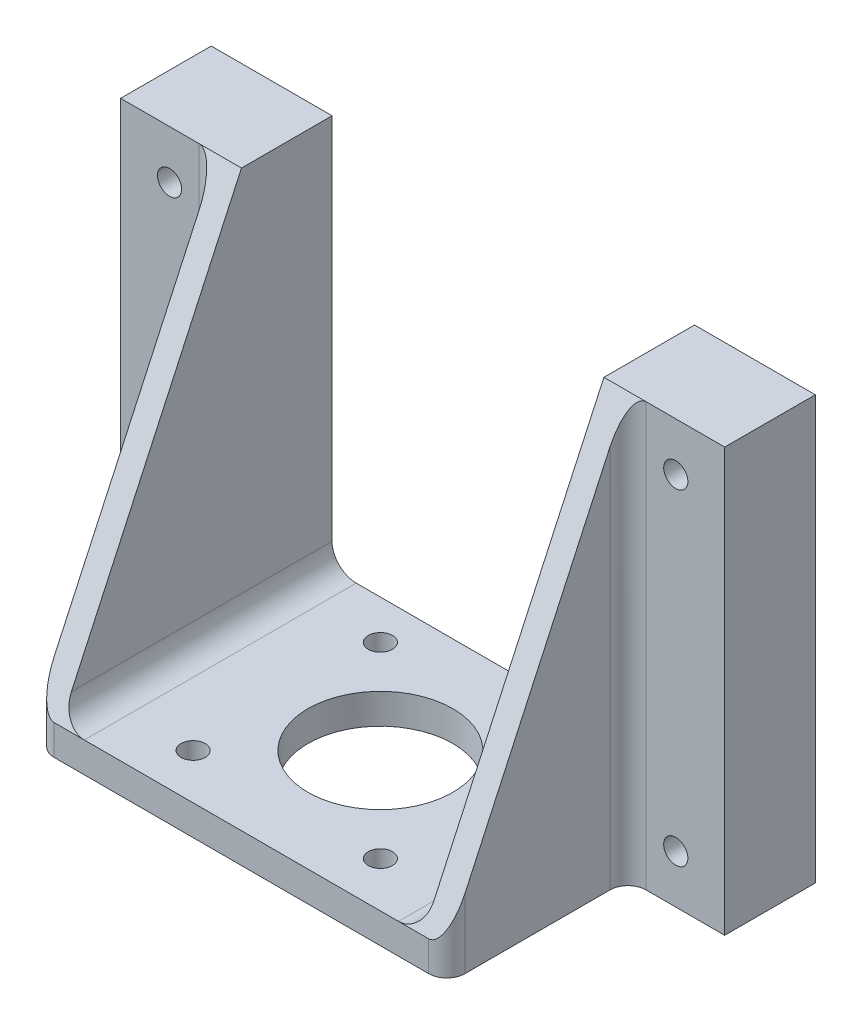
ISO-10303-21;
HEADER;
FILE_DESCRIPTION(('STEP AP214'),'2;1');
FILE_NAME('part.step','',(''),(''),'','','');
FILE_SCHEMA(('AUTOMOTIVE_DESIGN { 1 0 10303 214 1 1 1 1 }'));
ENDSEC;
DATA;
#1=APPLICATION_CONTEXT('core data for automotive mechanical design processes');
#2=APPLICATION_PROTOCOL_DEFINITION('international standard','automotive_design',2000,#1);
#3=PRODUCT_CONTEXT('',#1,'mechanical');
#4=PRODUCT('Part','Part','',(#3));
#5=PRODUCT_RELATED_PRODUCT_CATEGORY('part','',(#4));
#6=PRODUCT_DEFINITION_FORMATION('','',#4);
#7=PRODUCT_DEFINITION_CONTEXT('part definition',#1,'design');
#8=PRODUCT_DEFINITION('design','',#6,#7);
#9=PRODUCT_DEFINITION_SHAPE('','',#8);
#10=(LENGTH_UNIT() NAMED_UNIT(*) SI_UNIT(.MILLI.,.METRE.));
#11=(NAMED_UNIT(*) PLANE_ANGLE_UNIT() SI_UNIT($,.RADIAN.));
#12=(NAMED_UNIT(*) SI_UNIT($,.STERADIAN.) SOLID_ANGLE_UNIT());
#13=UNCERTAINTY_MEASURE_WITH_UNIT(LENGTH_MEASURE(1.E-05),#10,'distance_accuracy_value','');
#14=(GEOMETRIC_REPRESENTATION_CONTEXT(3) GLOBAL_UNCERTAINTY_ASSIGNED_CONTEXT((#13)) GLOBAL_UNIT_ASSIGNED_CONTEXT((#10,
#11,#12)) REPRESENTATION_CONTEXT('',''));
#15=CARTESIAN_POINT('',(0.,0.,0.));
#16=DIRECTION('',(0.,0.,1.));
#17=DIRECTION('',(1.,0.,0.));
#18=AXIS2_PLACEMENT_3D('',#15,#16,#17);
#19=CARTESIAN_POINT('',(0.,35.,0.0001));
#20=DIRECTION('',(0.,1.,0.));
#21=DIRECTION('',(0.,0.,1.));
#22=AXIS2_PLACEMENT_3D('',#19,#20,#21);
#23=PLANE('',#22);
#24=DIRECTION('',(0.,0.,-1.));
#25=VECTOR('',#24,1.);
#26=CARTESIAN_POINT('',(-30.,35.,45.0001));
#27=LINE('',#26,#25);
#28=CARTESIAN_POINT('',(-30.,35.,15.0001));
#29=VERTEX_POINT('',#28);
#30=CARTESIAN_POINT('',(-30.,35.,0.));
#31=VERTEX_POINT('',#30);
#32=EDGE_CURVE('E330',#29,#31,#27,.T.);
#33=ORIENTED_EDGE('',*,*,#32,.T.);
#34=DIRECTION('',(1.,0.,0.));
#35=VECTOR('',#34,1.);
#36=CARTESIAN_POINT('',(0.,35.,0.));
#37=LINE('',#36,#35);
#38=CARTESIAN_POINT('',(-50.,35.,0.));
#39=VERTEX_POINT('',#38);
#40=EDGE_CURVE('E225',#39,#31,#37,.T.);
#41=ORIENTED_EDGE('',*,*,#40,.F.);
#42=DIRECTION('',(0.,0.,-1.));
#43=VECTOR('',#42,1.);
#44=CARTESIAN_POINT('',(-50.,35.,0.0001));
#45=LINE('',#44,#43);
#46=CARTESIAN_POINT('',(-50.,35.,15.0001));
#47=VERTEX_POINT('',#46);
#48=EDGE_CURVE('E246',#47,#39,#45,.T.);
#49=ORIENTED_EDGE('',*,*,#48,.F.);
#50=DIRECTION('',(-1.,0.,0.));
#51=VECTOR('',#50,1.);
#52=CARTESIAN_POINT('',(-34.,35.,15.0001));
#53=LINE('',#52,#51);
#54=CARTESIAN_POINT('',(-37.,35.,15.0001));
#55=VERTEX_POINT('',#54);
#56=EDGE_CURVE('E367',#55,#47,#53,.T.);
#57=ORIENTED_EDGE('',*,*,#56,.F.);
#58=DIRECTION('',(-1.,0.,0.));
#59=VECTOR('',#58,1.);
#60=CARTESIAN_POINT('',(42.,35.,15.0001));
#61=LINE('',#60,#59);
#62=EDGE_CURVE('E382',#29,#55,#61,.T.);
#63=ORIENTED_EDGE('',*,*,#62,.F.);
#64=EDGE_LOOP('',(#33,#41,#49,#57,#63));
#65=FACE_BOUND('',#64,.T.);
#66=ADVANCED_FACE('F67',(#65),#23,.T.);
#67=CARTESIAN_POINT('',(0.,0.,15.0001));
#68=DIRECTION('',(0.,0.,1.));
#69=DIRECTION('',(1.,0.,0.));
#70=AXIS2_PLACEMENT_3D('',#67,#68,#69);
#71=PLANE('',#70);
#72=DIRECTION('',(-1.,0.,0.));
#73=VECTOR('',#72,1.);
#74=CARTESIAN_POINT('',(50.,35.,15.0001));
#75=LINE('',#74,#73);
#76=CARTESIAN_POINT('',(50.,35.,15.0001));
#77=VERTEX_POINT('',#76);
#78=CARTESIAN_POINT('',(37.,35.,15.0001));
#79=VERTEX_POINT('',#78);
#80=EDGE_CURVE('E375',#77,#79,#75,.T.);
#81=ORIENTED_EDGE('',*,*,#80,.T.);
#82=DIRECTION('',(0.,-1.,0.));
#83=VECTOR('',#82,1.);
#84=CARTESIAN_POINT('',(37.,0.,15.0001));
#85=LINE('',#84,#83);
#86=CARTESIAN_POINT('',(37.,-35.,15.0001));
#87=VERTEX_POINT('',#86);
#88=EDGE_CURVE('E290',#79,#87,#85,.T.);
#89=ORIENTED_EDGE('',*,*,#88,.T.);
#90=DIRECTION('',(1.,0.,0.));
#91=VECTOR('',#90,1.);
#92=CARTESIAN_POINT('',(34.,-35.,15.0001));
#93=LINE('',#92,#91);
#94=CARTESIAN_POINT('',(50.,-35.,15.0001));
#95=VERTEX_POINT('',#94);
#96=EDGE_CURVE('E378',#87,#95,#93,.T.);
#97=ORIENTED_EDGE('',*,*,#96,.T.);
#98=DIRECTION('',(0.,1.,0.));
#99=VECTOR('',#98,1.);
#100=CARTESIAN_POINT('',(50.,-35.,15.0001));
#101=LINE('',#100,#99);
#102=EDGE_CURVE('E372',#95,#77,#101,.T.);
#103=ORIENTED_EDGE('',*,*,#102,.T.);
#104=EDGE_LOOP('',(#81,#89,#97,#103));
#105=FACE_BOUND('',#104,.T.);
#106=CARTESIAN_POINT('',(41.8999999999999,27.,15.0001));
#107=DIRECTION('',(0.,0.,1.));
#108=DIRECTION('',(1.,0.,0.));
#109=AXIS2_PLACEMENT_3D('',#106,#107,#108);
#110=CIRCLE('',#109,2.00000000000002);
#111=CARTESIAN_POINT('',(43.9,27.,15.0001));
#112=VERTEX_POINT('',#111);
#113=EDGE_CURVE('E358',#112,#112,#110,.T.);
#114=ORIENTED_EDGE('',*,*,#113,.F.);
#115=EDGE_LOOP('',(#114));
#116=FACE_BOUND('',#115,.T.);
#117=CARTESIAN_POINT('',(41.8999999999999,-27.,15.0001));
#118=DIRECTION('',(0.,0.,1.));
#119=DIRECTION('',(1.,0.,0.));
#120=AXIS2_PLACEMENT_3D('',#117,#118,#119);
#121=CIRCLE('',#120,2.00000000000004);
#122=CARTESIAN_POINT('',(43.9,-27.,15.0001));
#123=VERTEX_POINT('',#122);
#124=EDGE_CURVE('E361',#123,#123,#121,.F.);
#125=ORIENTED_EDGE('',*,*,#124,.T.);
#126=EDGE_LOOP('',(#125));
#127=FACE_BOUND('',#126,.T.);
#128=ADVANCED_FACE('F425',(#105,#116,#127),#71,.T.);
#129=CARTESIAN_POINT('',(0.,0.,15.0001));
#130=DIRECTION('',(0.,0.,1.));
#131=DIRECTION('',(1.,0.,0.));
#132=AXIS2_PLACEMENT_3D('',#129,#130,#131);
#133=PLANE('',#132);
#134=CARTESIAN_POINT('',(-41.9,27.,15.0001));
#135=DIRECTION('',(0.,0.,1.));
#136=DIRECTION('',(1.,0.,0.));
#137=AXIS2_PLACEMENT_3D('',#134,#135,#136);
#138=CIRCLE('',#137,2.);
#139=CARTESIAN_POINT('',(-39.9,27.,15.0001));
#140=VERTEX_POINT('',#139);
#141=EDGE_CURVE('E355',#140,#140,#138,.F.);
#142=ORIENTED_EDGE('',*,*,#141,.T.);
#143=EDGE_LOOP('',(#142));
#144=FACE_BOUND('',#143,.T.);
#145=DIRECTION('',(1.,0.,0.));
#146=VECTOR('',#145,1.);
#147=CARTESIAN_POINT('',(-50.,-35.,15.0001));
#148=LINE('',#147,#146);
#149=CARTESIAN_POINT('',(-50.,-35.,15.0001));
#150=VERTEX_POINT('',#149);
#151=CARTESIAN_POINT('',(-37.,-35.,15.0001));
#152=VERTEX_POINT('',#151);
#153=EDGE_CURVE('E369',#150,#152,#148,.T.);
#154=ORIENTED_EDGE('',*,*,#153,.T.);
#155=DIRECTION('',(0.,1.,0.));
#156=VECTOR('',#155,1.);
#157=CARTESIAN_POINT('',(-37.,35.,15.0001));
#158=LINE('',#157,#156);
#159=EDGE_CURVE('E293',#152,#55,#158,.T.);
#160=ORIENTED_EDGE('',*,*,#159,.T.);
#161=ORIENTED_EDGE('',*,*,#56,.T.);
#162=DIRECTION('',(0.,-1.,0.));
#163=VECTOR('',#162,1.);
#164=CARTESIAN_POINT('',(-50.,35.,15.0001));
#165=LINE('',#164,#163);
#166=EDGE_CURVE('E364',#47,#150,#165,.T.);
#167=ORIENTED_EDGE('',*,*,#166,.T.);
#168=EDGE_LOOP('',(#154,#160,#161,#167));
#169=FACE_BOUND('',#168,.T.);
#170=CARTESIAN_POINT('',(-41.9,-27.,15.0001));
#171=DIRECTION('',(0.,0.,1.));
#172=DIRECTION('',(1.,0.,0.));
#173=AXIS2_PLACEMENT_3D('',#170,#171,#172);
#174=CIRCLE('',#173,1.99999999999999);
#175=CARTESIAN_POINT('',(-39.9,-27.,15.0001));
#176=VERTEX_POINT('',#175);
#177=EDGE_CURVE('E269',#176,#176,#174,.T.);
#178=ORIENTED_EDGE('',*,*,#177,.F.);
#179=EDGE_LOOP('',(#178));
#180=FACE_BOUND('',#179,.T.);
#181=ADVANCED_FACE('F431',(#144,#169,#180),#133,.T.);
#182=CARTESIAN_POINT('',(50.,0.,0.0001));
#183=DIRECTION('',(1.,0.,0.));
#184=DIRECTION('',(0.,0.,-1.));
#185=AXIS2_PLACEMENT_3D('',#182,#183,#184);
#186=PLANE('',#185);
#187=DIRECTION('',(0.,-1.,0.));
#188=VECTOR('',#187,1.);
#189=CARTESIAN_POINT('',(50.,0.,0.));
#190=LINE('',#189,#188);
#191=CARTESIAN_POINT('',(50.,35.,0.));
#192=VERTEX_POINT('',#191);
#193=CARTESIAN_POINT('',(50.,-35.,0.));
#194=VERTEX_POINT('',#193);
#195=EDGE_CURVE('E226',#192,#194,#190,.T.);
#196=ORIENTED_EDGE('',*,*,#195,.F.);
#197=DIRECTION('',(0.,0.,-1.));
#198=VECTOR('',#197,1.);
#199=CARTESIAN_POINT('',(50.,35.,0.0001));
#200=LINE('',#199,#198);
#201=EDGE_CURVE('E223',#77,#192,#200,.T.);
#202=ORIENTED_EDGE('',*,*,#201,.F.);
#203=ORIENTED_EDGE('',*,*,#102,.F.);
#204=DIRECTION('',(0.,0.,-1.));
#205=VECTOR('',#204,1.);
#206=CARTESIAN_POINT('',(50.,-35.,0.0001));
#207=LINE('',#206,#205);
#208=EDGE_CURVE('E241',#95,#194,#207,.T.);
#209=ORIENTED_EDGE('',*,*,#208,.T.);
#210=EDGE_LOOP('',(#196,#202,#203,#209));
#211=FACE_BOUND('',#210,.T.);
#212=ADVANCED_FACE('F438',(#211),#186,.T.);
#213=CARTESIAN_POINT('',(30.,35.,0.));
#214=VERTEX_POINT('',#213);
#215=EDGE_CURVE('E205',#214,#192,#37,.T.);
#216=ORIENTED_EDGE('',*,*,#215,.F.);
#217=DIRECTION('',(0.,0.,-1.));
#218=VECTOR('',#217,1.);
#219=CARTESIAN_POINT('',(30.,35.,45.0001));
#220=LINE('',#219,#218);
#221=CARTESIAN_POINT('',(30.,35.,15.0001));
#222=VERTEX_POINT('',#221);
#223=EDGE_CURVE('E213',#222,#214,#220,.T.);
#224=ORIENTED_EDGE('',*,*,#223,.F.);
#225=EDGE_CURVE('E384',#79,#222,#61,.T.);
#226=ORIENTED_EDGE('',*,*,#225,.F.);
#227=ORIENTED_EDGE('',*,*,#80,.F.);
#228=ORIENTED_EDGE('',*,*,#201,.T.);
#229=EDGE_LOOP('',(#216,#224,#226,#227,#228));
#230=FACE_BOUND('',#229,.T.);
#231=ADVANCED_FACE('F221',(#230),#23,.T.);
#232=CARTESIAN_POINT('',(-50.,0.,0.0001));
#233=DIRECTION('',(1.,0.,0.));
#234=DIRECTION('',(0.,1.,0.));
#235=AXIS2_PLACEMENT_3D('',#232,#233,#234);
#236=PLANE('',#235);
#237=DIRECTION('',(0.,-1.,0.));
#238=VECTOR('',#237,1.);
#239=CARTESIAN_POINT('',(-50.,0.,0.));
#240=LINE('',#239,#238);
#241=CARTESIAN_POINT('',(-50.,-35.,0.));
#242=VERTEX_POINT('',#241);
#243=EDGE_CURVE('E228',#39,#242,#240,.T.);
#244=ORIENTED_EDGE('',*,*,#243,.T.);
#245=DIRECTION('',(0.,0.,-1.));
#246=VECTOR('',#245,1.);
#247=CARTESIAN_POINT('',(-50.,-35.,0.0001));
#248=LINE('',#247,#246);
#249=EDGE_CURVE('E243',#150,#242,#248,.T.);
#250=ORIENTED_EDGE('',*,*,#249,.F.);
#251=ORIENTED_EDGE('',*,*,#166,.F.);
#252=ORIENTED_EDGE('',*,*,#48,.T.);
#253=EDGE_LOOP('',(#244,#250,#251,#252));
#254=FACE_BOUND('',#253,.T.);
#255=ADVANCED_FACE('F437',(#254),#236,.F.);
#256=CARTESIAN_POINT('',(0.,-35.,0.0001));
#257=DIRECTION('',(0.,1.,0.));
#258=DIRECTION('',(0.,0.,1.));
#259=AXIS2_PLACEMENT_3D('',#256,#257,#258);
#260=PLANE('',#259);
#261=CARTESIAN_POINT('',(15.5,-35.,37.5));
#262=DIRECTION('',(0.,-1.,0.));
#263=DIRECTION('',(0.,0.,-1.));
#264=AXIS2_PLACEMENT_3D('',#261,#262,#263);
#265=CIRCLE('',#264,2.00000000000001);
#266=CARTESIAN_POINT('',(15.5,-35.,35.5));
#267=VERTEX_POINT('',#266);
#268=EDGE_CURVE('E339',#267,#267,#265,.T.);
#269=ORIENTED_EDGE('',*,*,#268,.F.);
#270=EDGE_LOOP('',(#269));
#271=FACE_BOUND('',#270,.T.);
#272=CARTESIAN_POINT('',(-15.5,-35.,37.5));
#273=DIRECTION('',(0.,-1.,0.));
#274=DIRECTION('',(0.,0.,-1.));
#275=AXIS2_PLACEMENT_3D('',#272,#273,#274);
#276=CIRCLE('',#275,2.);
#277=CARTESIAN_POINT('',(-15.5,-35.,35.5));
#278=VERTEX_POINT('',#277);
#279=EDGE_CURVE('E346',#278,#278,#276,.T.);
#280=ORIENTED_EDGE('',*,*,#279,.F.);
#281=EDGE_LOOP('',(#280));
#282=FACE_BOUND('',#281,.T.);
#283=CARTESIAN_POINT('',(-15.5,-35.,6.5));
#284=DIRECTION('',(0.,-1.,0.));
#285=DIRECTION('',(0.,0.,-1.));
#286=AXIS2_PLACEMENT_3D('',#283,#284,#285);
#287=CIRCLE('',#286,2.);
#288=CARTESIAN_POINT('',(-15.5,-35.,4.5));
#289=VERTEX_POINT('',#288);
#290=EDGE_CURVE('E343',#289,#289,#287,.T.);
#291=ORIENTED_EDGE('',*,*,#290,.F.);
#292=EDGE_LOOP('',(#291));
#293=FACE_BOUND('',#292,.T.);
#294=CARTESIAN_POINT('',(15.5,-35.,6.5));
#295=DIRECTION('',(0.,-1.,0.));
#296=DIRECTION('',(0.,0.,-1.));
#297=AXIS2_PLACEMENT_3D('',#294,#295,#296);
#298=CIRCLE('',#297,2.);
#299=CARTESIAN_POINT('',(15.5,-35.,4.5));
#300=VERTEX_POINT('',#299);
#301=EDGE_CURVE('E340',#300,#300,#298,.T.);
#302=ORIENTED_EDGE('',*,*,#301,.F.);
#303=EDGE_LOOP('',(#302));
#304=FACE_BOUND('',#303,.T.);
#305=CARTESIAN_POINT('',(0.,-35.,22.));
#306=DIRECTION('',(0.,-1.,0.));
#307=DIRECTION('',(0.,0.,-1.));
#308=AXIS2_PLACEMENT_3D('',#305,#306,#307);
#309=CIRCLE('',#308,12.);
#310=CARTESIAN_POINT('',(0.,-35.,10.));
#311=VERTEX_POINT('',#310);
#312=EDGE_CURVE('E257',#311,#311,#309,.T.);
#313=ORIENTED_EDGE('',*,*,#312,.F.);
#314=EDGE_LOOP('',(#313));
#315=FACE_BOUND('',#314,.T.);
#316=DIRECTION('',(1.,0.,0.));
#317=VECTOR('',#316,1.);
#318=CARTESIAN_POINT('',(0.,-35.,45.0001));
#319=LINE('',#318,#317);
#320=CARTESIAN_POINT('',(-31.,-35.,45.0001));
#321=VERTEX_POINT('',#320);
#322=CARTESIAN_POINT('',(31.,-35.,45.0001));
#323=VERTEX_POINT('',#322);
#324=EDGE_CURVE('E395',#321,#323,#319,.T.);
#325=ORIENTED_EDGE('',*,*,#324,.F.);
#326=CARTESIAN_POINT('',(-31.,-35.,42.0001));
#327=DIRECTION('',(0.,1.,0.));
#328=DIRECTION('',(0.,0.,1.));
#329=AXIS2_PLACEMENT_3D('',#326,#327,#328);
#330=CIRCLE('',#329,3.);
#331=CARTESIAN_POINT('',(-34.,-35.,42.0001));
#332=VERTEX_POINT('',#331);
#333=EDGE_CURVE('E282',#321,#332,#330,.F.);
#334=ORIENTED_EDGE('',*,*,#333,.T.);
#335=DIRECTION('',(0.,0.,-1.));
#336=VECTOR('',#335,1.);
#337=CARTESIAN_POINT('',(-34.,-35.,45.0001));
#338=LINE('',#337,#336);
#339=CARTESIAN_POINT('',(-34.,-35.,18.0001));
#340=VERTEX_POINT('',#339);
#341=EDGE_CURVE('E390',#332,#340,#338,.T.);
#342=ORIENTED_EDGE('',*,*,#341,.T.);
#343=CARTESIAN_POINT('',(-37.,-35.,18.0001));
#344=DIRECTION('',(0.,1.,0.));
#345=DIRECTION('',(0.,0.,1.));
#346=AXIS2_PLACEMENT_3D('',#343,#344,#345);
#347=CIRCLE('',#346,3.);
#348=EDGE_CURVE('E303',#340,#152,#347,.T.);
#349=ORIENTED_EDGE('',*,*,#348,.T.);
#350=ORIENTED_EDGE('',*,*,#153,.F.);
#351=ORIENTED_EDGE('',*,*,#249,.T.);
#352=DIRECTION('',(1.,0.,0.));
#353=VECTOR('',#352,1.);
#354=CARTESIAN_POINT('',(0.,-35.,0.));
#355=LINE('',#354,#353);
#356=EDGE_CURVE('E235',#242,#194,#355,.T.);
#357=ORIENTED_EDGE('',*,*,#356,.T.);
#358=ORIENTED_EDGE('',*,*,#208,.F.);
#359=ORIENTED_EDGE('',*,*,#96,.F.);
#360=CARTESIAN_POINT('',(37.,-35.,18.0001));
#361=DIRECTION('',(0.,1.,0.));
#362=DIRECTION('',(0.,0.,1.));
#363=AXIS2_PLACEMENT_3D('',#360,#361,#362);
#364=CIRCLE('',#363,3.);
#365=CARTESIAN_POINT('',(34.,-35.,18.0001));
#366=VERTEX_POINT('',#365);
#367=EDGE_CURVE('E296',#87,#366,#364,.T.);
#368=ORIENTED_EDGE('',*,*,#367,.T.);
#369=DIRECTION('',(0.,0.,-1.));
#370=VECTOR('',#369,1.);
#371=CARTESIAN_POINT('',(34.,-35.,45.0001));
#372=LINE('',#371,#370);
#373=CARTESIAN_POINT('',(34.,-35.,42.0001));
#374=VERTEX_POINT('',#373);
#375=EDGE_CURVE('E218',#374,#366,#372,.T.);
#376=ORIENTED_EDGE('',*,*,#375,.F.);
#377=CARTESIAN_POINT('',(31.,-35.,42.0001));
#378=DIRECTION('',(0.,1.,0.));
#379=DIRECTION('',(0.,0.,1.));
#380=AXIS2_PLACEMENT_3D('',#377,#378,#379);
#381=CIRCLE('',#380,3.);
#382=EDGE_CURVE('E280',#374,#323,#381,.F.);
#383=ORIENTED_EDGE('',*,*,#382,.T.);
#384=EDGE_LOOP('',(#325,#334,#342,#349,#350,#351,#357,#358,#359,#368,#376,#383));
#385=FACE_BOUND('',#384,.T.);
#386=ADVANCED_FACE('F443',(#271,#282,#293,#304,#315,#385),#260,.F.);
#387=CARTESIAN_POINT('',(41.8999999999999,27.,0.0001));
#388=DIRECTION('',(0.,0.,-1.));
#389=DIRECTION('',(-1.,0.,0.));
#390=AXIS2_PLACEMENT_3D('',#387,#388,#389);
#391=CYLINDRICAL_SURFACE('',#390,2.00000000000002);
#392=CARTESIAN_POINT('',(41.8999999999999,27.,0.));
#393=DIRECTION('',(0.,0.,1.));
#394=DIRECTION('',(1.,0.,0.));
#395=AXIS2_PLACEMENT_3D('',#392,#393,#394);
#396=CIRCLE('',#395,2.00000000000002);
#397=CARTESIAN_POINT('',(43.9,27.,0.));
#398=VERTEX_POINT('',#397);
#399=EDGE_CURVE('E229',#398,#398,#396,.F.);
#400=ORIENTED_EDGE('',*,*,#399,.T.);
#401=EDGE_LOOP('',(#400));
#402=FACE_BOUND('',#401,.T.);
#403=ORIENTED_EDGE('',*,*,#113,.T.);
#404=EDGE_LOOP('',(#403));
#405=FACE_BOUND('',#404,.T.);
#406=ADVANCED_FACE('F406',(#402,#405),#391,.F.);
#407=CARTESIAN_POINT('',(-41.9,-27.,0.0001));
#408=DIRECTION('',(0.,0.,-1.));
#409=DIRECTION('',(-1.,0.,0.));
#410=AXIS2_PLACEMENT_3D('',#407,#408,#409);
#411=CYLINDRICAL_SURFACE('',#410,1.99999999999999);
#412=CARTESIAN_POINT('',(-41.9,-27.,0.));
#413=DIRECTION('',(0.,0.,1.));
#414=DIRECTION('',(1.,0.,0.));
#415=AXIS2_PLACEMENT_3D('',#412,#413,#414);
#416=CIRCLE('',#415,1.99999999999999);
#417=CARTESIAN_POINT('',(-39.9,-27.,0.));
#418=VERTEX_POINT('',#417);
#419=EDGE_CURVE('E401',#418,#418,#416,.F.);
#420=ORIENTED_EDGE('',*,*,#419,.T.);
#421=EDGE_LOOP('',(#420));
#422=FACE_BOUND('',#421,.T.);
#423=ORIENTED_EDGE('',*,*,#177,.T.);
#424=EDGE_LOOP('',(#423));
#425=FACE_BOUND('',#424,.T.);
#426=ADVANCED_FACE('F454',(#422,#425),#411,.F.);
#427=CARTESIAN_POINT('',(41.8999999999999,-27.,0.0001));
#428=DIRECTION('',(0.,0.,-1.));
#429=DIRECTION('',(-1.,0.,0.));
#430=AXIS2_PLACEMENT_3D('',#427,#428,#429);
#431=CYLINDRICAL_SURFACE('',#430,2.00000000000004);
#432=CARTESIAN_POINT('',(41.8999999999999,-27.,0.));
#433=DIRECTION('',(0.,0.,1.));
#434=DIRECTION('',(1.,0.,0.));
#435=AXIS2_PLACEMENT_3D('',#432,#433,#434);
#436=CIRCLE('',#435,2.00000000000004);
#437=CARTESIAN_POINT('',(43.9,-27.,0.));
#438=VERTEX_POINT('',#437);
#439=EDGE_CURVE('E398',#438,#438,#436,.T.);
#440=ORIENTED_EDGE('',*,*,#439,.F.);
#441=EDGE_LOOP('',(#440));
#442=FACE_BOUND('',#441,.T.);
#443=ORIENTED_EDGE('',*,*,#124,.F.);
#444=EDGE_LOOP('',(#443));
#445=FACE_BOUND('',#444,.T.);
#446=ADVANCED_FACE('F420',(#442,#445),#431,.F.);
#447=CARTESIAN_POINT('',(-41.9,27.,0.0001));
#448=DIRECTION('',(0.,0.,-1.));
#449=DIRECTION('',(-1.,0.,0.));
#450=AXIS2_PLACEMENT_3D('',#447,#448,#449);
#451=CYLINDRICAL_SURFACE('',#450,2.);
#452=CARTESIAN_POINT('',(-41.9,27.,0.));
#453=DIRECTION('',(0.,0.,1.));
#454=DIRECTION('',(1.,0.,0.));
#455=AXIS2_PLACEMENT_3D('',#452,#453,#454);
#456=CIRCLE('',#455,2.);
#457=CARTESIAN_POINT('',(-39.9,27.,0.));
#458=VERTEX_POINT('',#457);
#459=EDGE_CURVE('E238',#458,#458,#456,.T.);
#460=ORIENTED_EDGE('',*,*,#459,.F.);
#461=EDGE_LOOP('',(#460));
#462=FACE_BOUND('',#461,.T.);
#463=ORIENTED_EDGE('',*,*,#141,.F.);
#464=EDGE_LOOP('',(#463));
#465=FACE_BOUND('',#464,.T.);
#466=ADVANCED_FACE('F410',(#462,#465),#451,.F.);
#467=CARTESIAN_POINT('',(0.,0.,0.));
#468=DIRECTION('',(0.,0.,1.));
#469=DIRECTION('',(1.,0.,0.));
#470=AXIS2_PLACEMENT_3D('',#467,#468,#469);
#471=PLANE('',#470);
#472=ORIENTED_EDGE('',*,*,#439,.T.);
#473=EDGE_LOOP('',(#472));
#474=FACE_BOUND('',#473,.T.);
#475=ORIENTED_EDGE('',*,*,#419,.F.);
#476=EDGE_LOOP('',(#475));
#477=FACE_BOUND('',#476,.T.);
#478=ORIENTED_EDGE('',*,*,#399,.F.);
#479=EDGE_LOOP('',(#478));
#480=FACE_BOUND('',#479,.T.);
#481=ORIENTED_EDGE('',*,*,#40,.T.);
#482=DIRECTION('',(0.,-1.,0.));
#483=VECTOR('',#482,1.);
#484=CARTESIAN_POINT('',(-30.,35.,0.));
#485=LINE('',#484,#483);
#486=CARTESIAN_POINT('',(-30.,-26.,0.));
#487=VERTEX_POINT('',#486);
#488=EDGE_CURVE('E208',#31,#487,#485,.T.);
#489=ORIENTED_EDGE('',*,*,#488,.T.);
#490=CARTESIAN_POINT('',(-26.,-26.,0.));
#491=DIRECTION('',(0.,0.,1.));
#492=DIRECTION('',(1.,0.,0.));
#493=AXIS2_PLACEMENT_3D('',#490,#491,#492);
#494=CIRCLE('',#493,4.);
#495=CARTESIAN_POINT('',(-26.,-30.,0.));
#496=VERTEX_POINT('',#495);
#497=EDGE_CURVE('E314',#487,#496,#494,.T.);
#498=ORIENTED_EDGE('',*,*,#497,.T.);
#499=DIRECTION('',(1.,0.,0.));
#500=VECTOR('',#499,1.);
#501=CARTESIAN_POINT('',(-30.,-30.,0.));
#502=LINE('',#501,#500);
#503=CARTESIAN_POINT('',(26.,-30.,0.));
#504=VERTEX_POINT('',#503);
#505=EDGE_CURVE('E209',#496,#504,#502,.T.);
#506=ORIENTED_EDGE('',*,*,#505,.T.);
#507=CARTESIAN_POINT('',(26.,-26.,0.));
#508=DIRECTION('',(0.,0.,1.));
#509=DIRECTION('',(1.,0.,0.));
#510=AXIS2_PLACEMENT_3D('',#507,#508,#509);
#511=CIRCLE('',#510,4.);
#512=CARTESIAN_POINT('',(30.,-26.,0.));
#513=VERTEX_POINT('',#512);
#514=EDGE_CURVE('E75',#504,#513,#511,.T.);
#515=ORIENTED_EDGE('',*,*,#514,.T.);
#516=DIRECTION('',(0.,1.,0.));
#517=VECTOR('',#516,1.);
#518=CARTESIAN_POINT('',(30.,-30.,0.));
#519=LINE('',#518,#517);
#520=EDGE_CURVE('E198',#513,#214,#519,.T.);
#521=ORIENTED_EDGE('',*,*,#520,.T.);
#522=ORIENTED_EDGE('',*,*,#215,.T.);
#523=ORIENTED_EDGE('',*,*,#195,.T.);
#524=ORIENTED_EDGE('',*,*,#356,.F.);
#525=ORIENTED_EDGE('',*,*,#243,.F.);
#526=EDGE_LOOP('',(#481,#489,#498,#506,#515,#521,#522,#523,#524,#525));
#527=FACE_BOUND('',#526,.T.);
#528=ORIENTED_EDGE('',*,*,#459,.T.);
#529=EDGE_LOOP('',(#528));
#530=FACE_BOUND('',#529,.T.);
#531=ADVANCED_FACE('F201',(#474,#477,#480,#527,#530),#471,.F.);
#532=CARTESIAN_POINT('',(0.,-30.,45.0001));
#533=DIRECTION('',(0.,1.,0.));
#534=DIRECTION('',(-1.,0.,0.));
#535=AXIS2_PLACEMENT_3D('',#532,#533,#534);
#536=PLANE('',#535);
#537=CARTESIAN_POINT('',(15.5,-30.,37.5));
#538=DIRECTION('',(0.,1.,0.));
#539=DIRECTION('',(-1.,0.,0.));
#540=AXIS2_PLACEMENT_3D('',#537,#538,#539);
#541=CIRCLE('',#540,2.00000000000001);
#542=CARTESIAN_POINT('',(13.5,-30.,37.5));
#543=VERTEX_POINT('',#542);
#544=EDGE_CURVE('E266',#543,#543,#541,.T.);
#545=ORIENTED_EDGE('',*,*,#544,.F.);
#546=EDGE_LOOP('',(#545));
#547=FACE_BOUND('',#546,.T.);
#548=CARTESIAN_POINT('',(-15.5,-30.,37.5));
#549=DIRECTION('',(0.,1.,0.));
#550=DIRECTION('',(-1.,0.,0.));
#551=AXIS2_PLACEMENT_3D('',#548,#549,#550);
#552=CIRCLE('',#551,2.);
#553=CARTESIAN_POINT('',(-17.5,-30.,37.5));
#554=VERTEX_POINT('',#553);
#555=EDGE_CURVE('E263',#554,#554,#552,.T.);
#556=ORIENTED_EDGE('',*,*,#555,.F.);
#557=EDGE_LOOP('',(#556));
#558=FACE_BOUND('',#557,.T.);
#559=CARTESIAN_POINT('',(-15.5,-30.,6.5));
#560=DIRECTION('',(0.,1.,0.));
#561=DIRECTION('',(-1.,0.,0.));
#562=AXIS2_PLACEMENT_3D('',#559,#560,#561);
#563=CIRCLE('',#562,2.);
#564=CARTESIAN_POINT('',(-17.5,-30.,6.5));
#565=VERTEX_POINT('',#564);
#566=EDGE_CURVE('E260',#565,#565,#563,.T.);
#567=ORIENTED_EDGE('',*,*,#566,.F.);
#568=EDGE_LOOP('',(#567));
#569=FACE_BOUND('',#568,.T.);
#570=CARTESIAN_POINT('',(15.5,-30.,6.5));
#571=DIRECTION('',(0.,1.,0.));
#572=DIRECTION('',(-1.,0.,0.));
#573=AXIS2_PLACEMENT_3D('',#570,#571,#572);
#574=CIRCLE('',#573,2.);
#575=CARTESIAN_POINT('',(13.5,-30.,6.5));
#576=VERTEX_POINT('',#575);
#577=EDGE_CURVE('E256',#576,#576,#574,.T.);
#578=ORIENTED_EDGE('',*,*,#577,.F.);
#579=EDGE_LOOP('',(#578));
#580=FACE_BOUND('',#579,.T.);
#581=CARTESIAN_POINT('',(0.,-30.,22.));
#582=DIRECTION('',(0.,1.,0.));
#583=DIRECTION('',(-1.,0.,0.));
#584=AXIS2_PLACEMENT_3D('',#581,#582,#583);
#585=CIRCLE('',#584,12.);
#586=CARTESIAN_POINT('',(-12.,-30.,22.));
#587=VERTEX_POINT('',#586);
#588=EDGE_CURVE('E253',#587,#587,#585,.T.);
#589=ORIENTED_EDGE('',*,*,#588,.F.);
#590=EDGE_LOOP('',(#589));
#591=FACE_BOUND('',#590,.T.);
#592=ORIENTED_EDGE('',*,*,#505,.F.);
#593=DIRECTION('',(0.,0.,-1.));
#594=VECTOR('',#593,1.);
#595=CARTESIAN_POINT('',(-26.,-30.,45.0001));
#596=LINE('',#595,#594);
#597=CARTESIAN_POINT('',(-26.,-30.,45.0001));
#598=VERTEX_POINT('',#597);
#599=EDGE_CURVE('E310',#496,#598,#596,.F.);
#600=ORIENTED_EDGE('',*,*,#599,.T.);
#601=DIRECTION('',(1.,0.,0.));
#602=VECTOR('',#601,1.);
#603=CARTESIAN_POINT('',(0.,-30.,45.0001));
#604=LINE('',#603,#602);
#605=CARTESIAN_POINT('',(26.,-30.,45.0001));
#606=VERTEX_POINT('',#605);
#607=EDGE_CURVE('E393',#598,#606,#604,.T.);
#608=ORIENTED_EDGE('',*,*,#607,.T.);
#609=DIRECTION('',(0.,0.,-1.));
#610=VECTOR('',#609,1.);
#611=CARTESIAN_POINT('',(26.,-30.,0.));
#612=LINE('',#611,#610);
#613=EDGE_CURVE('E308',#606,#504,#612,.T.);
#614=ORIENTED_EDGE('',*,*,#613,.T.);
#615=EDGE_LOOP('',(#592,#600,#608,#614));
#616=FACE_BOUND('',#615,.T.);
#617=ADVANCED_FACE('F335',(#547,#558,#569,#580,#591,#616),#536,.T.);
#618=CARTESIAN_POINT('',(0.,0.,45.0001));
#619=DIRECTION('',(0.,0.,1.));
#620=DIRECTION('',(1.,0.,0.));
#621=AXIS2_PLACEMENT_3D('',#618,#619,#620);
#622=PLANE('',#621);
#623=DIRECTION('',(-1.,0.,0.));
#624=VECTOR('',#623,1.);
#625=CARTESIAN_POINT('',(42.,-30.,45.0001));
#626=LINE('',#625,#624);
#627=CARTESIAN_POINT('',(-31.,-30.,45.0001));
#628=VERTEX_POINT('',#627);
#629=EDGE_CURVE('E102',#598,#628,#626,.T.);
#630=ORIENTED_EDGE('',*,*,#629,.T.);
#631=DIRECTION('',(0.,1.,0.));
#632=VECTOR('',#631,1.);
#633=CARTESIAN_POINT('',(-31.,0.,45.0001));
#634=LINE('',#633,#632);
#635=EDGE_CURVE('E278',#628,#321,#634,.F.);
#636=ORIENTED_EDGE('',*,*,#635,.T.);
#637=ORIENTED_EDGE('',*,*,#324,.T.);
#638=DIRECTION('',(0.,1.,0.));
#639=VECTOR('',#638,1.);
#640=CARTESIAN_POINT('',(31.,-30.,45.0001));
#641=LINE('',#640,#639);
#642=CARTESIAN_POINT('',(31.,-30.,45.0001));
#643=VERTEX_POINT('',#642);
#644=EDGE_CURVE('E276',#323,#643,#641,.T.);
#645=ORIENTED_EDGE('',*,*,#644,.T.);
#646=EDGE_CURVE('E82',#643,#606,#626,.T.);
#647=ORIENTED_EDGE('',*,*,#646,.T.);
#648=ORIENTED_EDGE('',*,*,#607,.F.);
#649=EDGE_LOOP('',(#630,#636,#637,#645,#647,#648));
#650=FACE_BOUND('',#649,.T.);
#651=ADVANCED_FACE('F417',(#650),#622,.T.);
#652=CARTESIAN_POINT('',(-34.,0.,45.0001));
#653=DIRECTION('',(-1.,0.,0.));
#654=DIRECTION('',(0.,0.,1.));
#655=AXIS2_PLACEMENT_3D('',#652,#653,#654);
#656=PLANE('',#655);
#657=ORIENTED_EDGE('',*,*,#341,.F.);
#658=DIRECTION('',(0.,1.,0.));
#659=VECTOR('',#658,1.);
#660=CARTESIAN_POINT('',(-34.,0.,42.0001));
#661=LINE('',#660,#659);
#662=CARTESIAN_POINT('',(-34.,-23.5,42.0001));
#663=VERTEX_POINT('',#662);
#664=EDGE_CURVE('E271',#332,#663,#661,.T.);
#665=ORIENTED_EDGE('',*,*,#664,.T.);
#666=DIRECTION('',(0.,-0.907959384500452,0.419058177461747));
#667=VECTOR('',#666,1.);
#668=CARTESIAN_POINT('',(-34.,-30.,45.0001));
#669=LINE('',#668,#667);
#670=CARTESIAN_POINT('',(-34.,28.5,18.0001));
#671=VERTEX_POINT('',#670);
#672=EDGE_CURVE('E380',#671,#663,#669,.T.);
#673=ORIENTED_EDGE('',*,*,#672,.F.);
#674=DIRECTION('',(0.,1.,0.));
#675=VECTOR('',#674,1.);
#676=CARTESIAN_POINT('',(-34.,-35.,18.0001));
#677=LINE('',#676,#675);
#678=EDGE_CURVE('E252',#671,#340,#677,.F.);
#679=ORIENTED_EDGE('',*,*,#678,.T.);
#680=EDGE_LOOP('',(#657,#665,#673,#679));
#681=FACE_BOUND('',#680,.T.);
#682=ADVANCED_FACE('F512',(#681),#656,.T.);
#683=CARTESIAN_POINT('',(-30.,0.,45.0001));
#684=DIRECTION('',(-1.,0.,0.));
#685=DIRECTION('',(0.,-1.,0.));
#686=AXIS2_PLACEMENT_3D('',#683,#684,#685);
#687=PLANE('',#686);
#688=DIRECTION('',(0.,-0.907959384500452,0.419058177461747));
#689=VECTOR('',#688,1.);
#690=CARTESIAN_POINT('',(-30.,-5.26829268292681,33.5854658536585));
#691=LINE('',#690,#689);
#692=CARTESIAN_POINT('',(-30.,-26.,43.1539461538462));
#693=VERTEX_POINT('',#692);
#694=EDGE_CURVE('E219',#29,#693,#691,.T.);
#695=ORIENTED_EDGE('',*,*,#694,.T.);
#696=DIRECTION('',(0.,0.,-1.));
#697=VECTOR('',#696,1.);
#698=CARTESIAN_POINT('',(-30.,-26.,45.0001));
#699=LINE('',#698,#697);
#700=EDGE_CURVE('E305',#693,#487,#699,.T.);
#701=ORIENTED_EDGE('',*,*,#700,.T.);
#702=ORIENTED_EDGE('',*,*,#488,.F.);
#703=ORIENTED_EDGE('',*,*,#32,.F.);
#704=EDGE_LOOP('',(#695,#701,#702,#703));
#705=FACE_BOUND('',#704,.T.);
#706=ADVANCED_FACE('F327',(#705),#687,.F.);
#707=CARTESIAN_POINT('',(30.,0.,45.0001));
#708=DIRECTION('',(-1.,0.,0.));
#709=DIRECTION('',(0.,-1.,0.));
#710=AXIS2_PLACEMENT_3D('',#707,#708,#709);
#711=PLANE('',#710);
#712=ORIENTED_EDGE('',*,*,#520,.F.);
#713=DIRECTION('',(0.,0.,-1.));
#714=VECTOR('',#713,1.);
#715=CARTESIAN_POINT('',(30.,-26.,45.0001));
#716=LINE('',#715,#714);
#717=CARTESIAN_POINT('',(30.,-26.,43.1539461538462));
#718=VERTEX_POINT('',#717);
#719=EDGE_CURVE('E312',#513,#718,#716,.F.);
#720=ORIENTED_EDGE('',*,*,#719,.T.);
#721=DIRECTION('',(0.,-0.907959384500452,0.419058177461747));
#722=VECTOR('',#721,1.);
#723=CARTESIAN_POINT('',(30.,-5.26829268292683,33.5854658536585));
#724=LINE('',#723,#722);
#725=EDGE_CURVE('E216',#222,#718,#724,.T.);
#726=ORIENTED_EDGE('',*,*,#725,.F.);
#727=ORIENTED_EDGE('',*,*,#223,.T.);
#728=EDGE_LOOP('',(#712,#720,#726,#727));
#729=FACE_BOUND('',#728,.T.);
#730=ADVANCED_FACE('F214',(#729),#711,.T.);
#731=CARTESIAN_POINT('',(34.,0.,45.0001));
#732=DIRECTION('',(-1.,0.,0.));
#733=DIRECTION('',(0.,-1.,0.));
#734=AXIS2_PLACEMENT_3D('',#731,#732,#733);
#735=PLANE('',#734);
#736=DIRECTION('',(0.,-0.907959384500452,0.419058177461747));
#737=VECTOR('',#736,1.);
#738=CARTESIAN_POINT('',(34.,-5.26829268292682,33.5854658536585));
#739=LINE('',#738,#737);
#740=CARTESIAN_POINT('',(34.,28.5,18.0001));
#741=VERTEX_POINT('',#740);
#742=CARTESIAN_POINT('',(34.,-23.5,42.0001));
#743=VERTEX_POINT('',#742);
#744=EDGE_CURVE('E249',#741,#743,#739,.T.);
#745=ORIENTED_EDGE('',*,*,#744,.T.);
#746=DIRECTION('',(0.,1.,0.));
#747=VECTOR('',#746,1.);
#748=CARTESIAN_POINT('',(34.,-35.,42.0001));
#749=LINE('',#748,#747);
#750=EDGE_CURVE('E288',#743,#374,#749,.F.);
#751=ORIENTED_EDGE('',*,*,#750,.T.);
#752=ORIENTED_EDGE('',*,*,#375,.T.);
#753=DIRECTION('',(0.,-1.,0.));
#754=VECTOR('',#753,1.);
#755=CARTESIAN_POINT('',(34.,0.,18.0001));
#756=LINE('',#755,#754);
#757=EDGE_CURVE('E286',#366,#741,#756,.F.);
#758=ORIENTED_EDGE('',*,*,#757,.T.);
#759=EDGE_LOOP('',(#745,#751,#752,#758));
#760=FACE_BOUND('',#759,.T.);
#761=ADVANCED_FACE('F520',(#760),#735,.F.);
#762=CARTESIAN_POINT('',(42.,-30.,45.0001));
#763=DIRECTION('',(0.,-0.419058177461747,-0.907959384500452));
#764=DIRECTION('',(0.,0.907959384500452,-0.419058177461747));
#765=AXIS2_PLACEMENT_3D('',#762,#763,#764);
#766=PLANE('',#765);
#767=ORIENTED_EDGE('',*,*,#646,.F.);
#768=CARTESIAN_POINT('',(31.,-23.5,42.0001));
#769=DIRECTION('',(0.,-0.419058177461747,-0.907959384500452));
#770=DIRECTION('',(0.,-0.907959384500452,0.419058177461747));
#771=AXIS2_PLACEMENT_3D('',#768,#769,#770);
#772=ELLIPSE('',#771,7.15891053163818,3.);
#773=EDGE_CURVE('E284',#643,#743,#772,.F.);
#774=ORIENTED_EDGE('',*,*,#773,.T.);
#775=ORIENTED_EDGE('',*,*,#744,.F.);
#776=CARTESIAN_POINT('',(37.,28.5,18.0001));
#777=DIRECTION('',(0.,-0.419058177461747,-0.907959384500452));
#778=DIRECTION('',(0.,-0.907959384500452,0.419058177461747));
#779=AXIS2_PLACEMENT_3D('',#776,#777,#778);
#780=ELLIPSE('',#779,7.15891053163818,3.);
#781=EDGE_CURVE('E298',#741,#79,#780,.T.);
#782=ORIENTED_EDGE('',*,*,#781,.T.);
#783=ORIENTED_EDGE('',*,*,#225,.T.);
#784=ORIENTED_EDGE('',*,*,#725,.T.);
#785=CARTESIAN_POINT('',(26.,-26.,43.1539461538462));
#786=DIRECTION('',(0.,-0.419058177461747,-0.907959384500452));
#787=DIRECTION('',(0.,-0.907959384500452,0.419058177461747));
#788=AXIS2_PLACEMENT_3D('',#785,#786,#787);
#789=ELLIPSE('',#788,4.40548340408503,4.);
#790=EDGE_CURVE('E12',#718,#606,#789,.T.);
#791=ORIENTED_EDGE('',*,*,#790,.T.);
#792=EDGE_LOOP('',(#767,#774,#775,#782,#783,#784,#791));
#793=FACE_BOUND('',#792,.T.);
#794=ADVANCED_FACE('F485',(#793),#766,.F.);
#795=ORIENTED_EDGE('',*,*,#672,.T.);
#796=CARTESIAN_POINT('',(-31.,-23.5,42.0001));
#797=DIRECTION('',(0.,-0.419058177461747,-0.907959384500452));
#798=DIRECTION('',(0.,0.907959384500452,-0.419058177461747));
#799=AXIS2_PLACEMENT_3D('',#796,#797,#798);
#800=ELLIPSE('',#799,7.15891053163818,3.);
#801=EDGE_CURVE('E274',#663,#628,#800,.F.);
#802=ORIENTED_EDGE('',*,*,#801,.T.);
#803=ORIENTED_EDGE('',*,*,#629,.F.);
#804=CARTESIAN_POINT('',(-26.,-26.,43.1539461538462));
#805=DIRECTION('',(0.,-0.419058177461747,-0.907959384500452));
#806=DIRECTION('',(0.,0.907959384500452,-0.419058177461747));
#807=AXIS2_PLACEMENT_3D('',#804,#805,#806);
#808=ELLIPSE('',#807,4.40548340408503,4.);
#809=EDGE_CURVE('E316',#598,#693,#808,.T.);
#810=ORIENTED_EDGE('',*,*,#809,.T.);
#811=ORIENTED_EDGE('',*,*,#694,.F.);
#812=ORIENTED_EDGE('',*,*,#62,.T.);
#813=CARTESIAN_POINT('',(-37.,28.5,18.0001));
#814=DIRECTION('',(0.,-0.419058177461747,-0.907959384500452));
#815=DIRECTION('',(0.,-0.907959384500452,0.419058177461747));
#816=AXIS2_PLACEMENT_3D('',#813,#814,#815);
#817=ELLIPSE('',#816,7.15891053163818,3.);
#818=EDGE_CURVE('E301',#55,#671,#817,.T.);
#819=ORIENTED_EDGE('',*,*,#818,.T.);
#820=EDGE_LOOP('',(#795,#802,#803,#810,#811,#812,#819));
#821=FACE_BOUND('',#820,.T.);
#822=ADVANCED_FACE('F320',(#821),#766,.F.);
#823=CARTESIAN_POINT('',(0.,35.,22.));
#824=DIRECTION('',(0.,-1.,0.));
#825=DIRECTION('',(0.,0.,-1.));
#826=AXIS2_PLACEMENT_3D('',#823,#824,#825);
#827=CYLINDRICAL_SURFACE('',#826,12.);
#828=ORIENTED_EDGE('',*,*,#588,.T.);
#829=EDGE_LOOP('',(#828));
#830=FACE_BOUND('',#829,.T.);
#831=ORIENTED_EDGE('',*,*,#312,.T.);
#832=EDGE_LOOP('',(#831));
#833=FACE_BOUND('',#832,.T.);
#834=ADVANCED_FACE('F572',(#830,#833),#827,.F.);
#835=CARTESIAN_POINT('',(15.5,35.,6.5));
#836=DIRECTION('',(0.,-1.,0.));
#837=DIRECTION('',(0.,0.,-1.));
#838=AXIS2_PLACEMENT_3D('',#835,#836,#837);
#839=CYLINDRICAL_SURFACE('',#838,2.);
#840=ORIENTED_EDGE('',*,*,#577,.T.);
#841=EDGE_LOOP('',(#840));
#842=FACE_BOUND('',#841,.T.);
#843=ORIENTED_EDGE('',*,*,#301,.T.);
#844=EDGE_LOOP('',(#843));
#845=FACE_BOUND('',#844,.T.);
#846=ADVANCED_FACE('F648',(#842,#845),#839,.F.);
#847=CARTESIAN_POINT('',(-15.5,35.,6.5));
#848=DIRECTION('',(0.,-1.,0.));
#849=DIRECTION('',(0.,0.,-1.));
#850=AXIS2_PLACEMENT_3D('',#847,#848,#849);
#851=CYLINDRICAL_SURFACE('',#850,2.);
#852=ORIENTED_EDGE('',*,*,#566,.T.);
#853=EDGE_LOOP('',(#852));
#854=FACE_BOUND('',#853,.T.);
#855=ORIENTED_EDGE('',*,*,#290,.T.);
#856=EDGE_LOOP('',(#855));
#857=FACE_BOUND('',#856,.T.);
#858=ADVANCED_FACE('F638',(#854,#857),#851,.F.);
#859=CARTESIAN_POINT('',(-15.5,35.,37.5));
#860=DIRECTION('',(0.,-1.,0.));
#861=DIRECTION('',(0.,0.,-1.));
#862=AXIS2_PLACEMENT_3D('',#859,#860,#861);
#863=CYLINDRICAL_SURFACE('',#862,2.);
#864=ORIENTED_EDGE('',*,*,#555,.T.);
#865=EDGE_LOOP('',(#864));
#866=FACE_BOUND('',#865,.T.);
#867=ORIENTED_EDGE('',*,*,#279,.T.);
#868=EDGE_LOOP('',(#867));
#869=FACE_BOUND('',#868,.T.);
#870=ADVANCED_FACE('F628',(#866,#869),#863,.F.);
#871=CARTESIAN_POINT('',(15.5,35.,37.5));
#872=DIRECTION('',(0.,-1.,0.));
#873=DIRECTION('',(0.,0.,-1.));
#874=AXIS2_PLACEMENT_3D('',#871,#872,#873);
#875=CYLINDRICAL_SURFACE('',#874,2.00000000000001);
#876=ORIENTED_EDGE('',*,*,#544,.T.);
#877=EDGE_LOOP('',(#876));
#878=FACE_BOUND('',#877,.T.);
#879=ORIENTED_EDGE('',*,*,#268,.T.);
#880=EDGE_LOOP('',(#879));
#881=FACE_BOUND('',#880,.T.);
#882=ADVANCED_FACE('F465',(#878,#881),#875,.F.);
#883=CARTESIAN_POINT('',(-31.,0.,42.0001));
#884=DIRECTION('',(0.,1.,0.));
#885=DIRECTION('',(0.,0.,1.));
#886=AXIS2_PLACEMENT_3D('',#883,#884,#885);
#887=CYLINDRICAL_SURFACE('',#886,3.);
#888=ORIENTED_EDGE('',*,*,#333,.F.);
#889=ORIENTED_EDGE('',*,*,#635,.F.);
#890=ORIENTED_EDGE('',*,*,#801,.F.);
#891=ORIENTED_EDGE('',*,*,#664,.F.);
#892=EDGE_LOOP('',(#888,#889,#890,#891));
#893=FACE_BOUND('',#892,.T.);
#894=ADVANCED_FACE('F461',(#893),#887,.T.);
#895=CARTESIAN_POINT('',(31.,0.,42.0001));
#896=DIRECTION('',(0.,-1.,0.));
#897=DIRECTION('',(1.,0.,0.));
#898=AXIS2_PLACEMENT_3D('',#895,#896,#897);
#899=CYLINDRICAL_SURFACE('',#898,3.);
#900=ORIENTED_EDGE('',*,*,#382,.F.);
#901=ORIENTED_EDGE('',*,*,#750,.F.);
#902=ORIENTED_EDGE('',*,*,#773,.F.);
#903=ORIENTED_EDGE('',*,*,#644,.F.);
#904=EDGE_LOOP('',(#900,#901,#902,#903));
#905=FACE_BOUND('',#904,.T.);
#906=ADVANCED_FACE('F464',(#905),#899,.T.);
#907=CARTESIAN_POINT('',(37.,0.,18.0001));
#908=DIRECTION('',(0.,-1.,0.));
#909=DIRECTION('',(1.,0.,0.));
#910=AXIS2_PLACEMENT_3D('',#907,#908,#909);
#911=CYLINDRICAL_SURFACE('',#910,3.);
#912=ORIENTED_EDGE('',*,*,#781,.F.);
#913=ORIENTED_EDGE('',*,*,#757,.F.);
#914=ORIENTED_EDGE('',*,*,#367,.F.);
#915=ORIENTED_EDGE('',*,*,#88,.F.);
#916=EDGE_LOOP('',(#912,#913,#914,#915));
#917=FACE_BOUND('',#916,.T.);
#918=ADVANCED_FACE('F469',(#917),#911,.F.);
#919=CARTESIAN_POINT('',(-37.,0.,18.0001));
#920=DIRECTION('',(0.,-1.,0.));
#921=DIRECTION('',(0.,0.,-1.));
#922=AXIS2_PLACEMENT_3D('',#919,#920,#921);
#923=CYLINDRICAL_SURFACE('',#922,3.);
#924=ORIENTED_EDGE('',*,*,#348,.F.);
#925=ORIENTED_EDGE('',*,*,#678,.F.);
#926=ORIENTED_EDGE('',*,*,#818,.F.);
#927=ORIENTED_EDGE('',*,*,#159,.F.);
#928=EDGE_LOOP('',(#924,#925,#926,#927));
#929=FACE_BOUND('',#928,.T.);
#930=ADVANCED_FACE('F473',(#929),#923,.F.);
#931=CARTESIAN_POINT('',(-26.,-26.,45.0001));
#932=DIRECTION('',(0.,0.,-1.));
#933=DIRECTION('',(-1.,0.,0.));
#934=AXIS2_PLACEMENT_3D('',#931,#932,#933);
#935=CYLINDRICAL_SURFACE('',#934,4.);
#936=ORIENTED_EDGE('',*,*,#809,.F.);
#937=ORIENTED_EDGE('',*,*,#599,.F.);
#938=ORIENTED_EDGE('',*,*,#497,.F.);
#939=ORIENTED_EDGE('',*,*,#700,.F.);
#940=EDGE_LOOP('',(#936,#937,#938,#939));
#941=FACE_BOUND('',#940,.T.);
#942=ADVANCED_FACE('F332',(#941),#935,.F.);
#943=CARTESIAN_POINT('',(26.,-26.,45.0001));
#944=DIRECTION('',(0.,0.,1.));
#945=DIRECTION('',(1.,0.,0.));
#946=AXIS2_PLACEMENT_3D('',#943,#944,#945);
#947=CYLINDRICAL_SURFACE('',#946,4.);
#948=ORIENTED_EDGE('',*,*,#790,.F.);
#949=ORIENTED_EDGE('',*,*,#719,.F.);
#950=ORIENTED_EDGE('',*,*,#514,.F.);
#951=ORIENTED_EDGE('',*,*,#613,.F.);
#952=EDGE_LOOP('',(#948,#949,#950,#951));
#953=FACE_BOUND('',#952,.T.);
#954=ADVANCED_FACE('F69',(#953),#947,.F.);
#955=CLOSED_SHELL('',(#66,#128,#181,#212,#231,#255,#386,#406,#426,#446,#466,#531,#617,#651,#682,
#706,#730,#761,#794,#822,#834,#846,#858,#870,#882,#894,#906,#918,#930,#942,#954));
#956=MANIFOLD_SOLID_BREP('B2',#955);
#957=ADVANCED_BREP_SHAPE_REPRESENTATION('',(#18,#956),#14);
#958=SHAPE_DEFINITION_REPRESENTATION(#9,#957);
ENDSEC;
END-ISO-10303-21;
